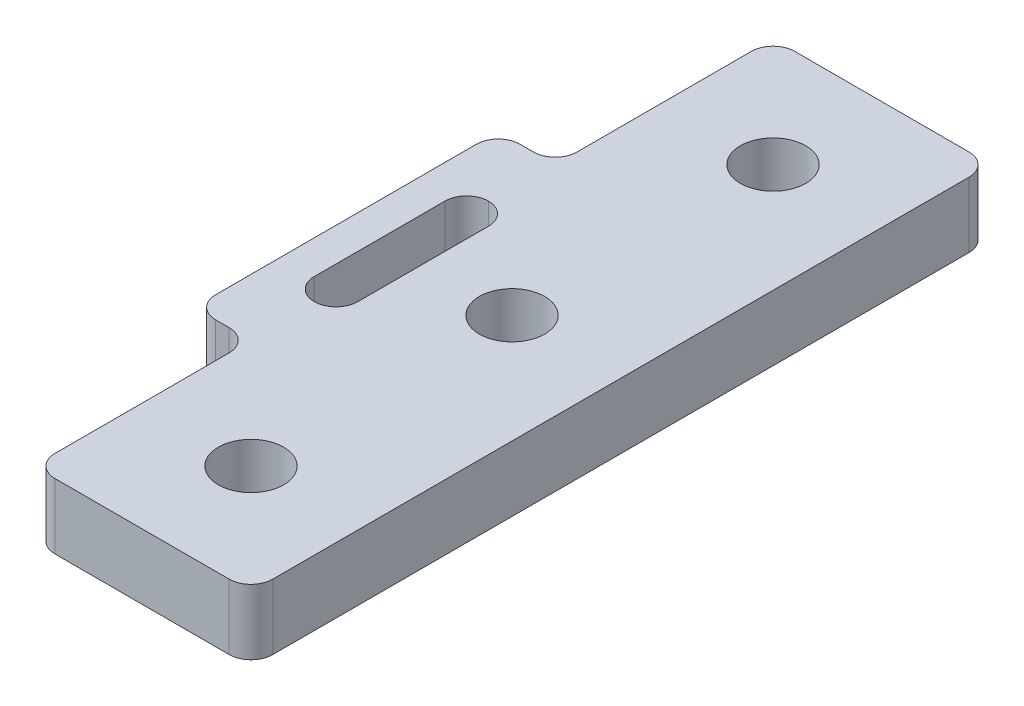
ISO-10303-21;
HEADER;
FILE_DESCRIPTION(('STEP AP214'),'2;1');
FILE_NAME('part.step','',(''),(''),'','','');
FILE_SCHEMA(('AUTOMOTIVE_DESIGN { 1 0 10303 214 1 1 1 1 }'));
ENDSEC;
DATA;
#1=APPLICATION_CONTEXT('core data for automotive mechanical design processes');
#2=APPLICATION_PROTOCOL_DEFINITION('international standard','automotive_design',2000,#1);
#3=PRODUCT_CONTEXT('',#1,'mechanical');
#4=PRODUCT('Part','Part','',(#3));
#5=PRODUCT_RELATED_PRODUCT_CATEGORY('part','',(#4));
#6=PRODUCT_DEFINITION_FORMATION('','',#4);
#7=PRODUCT_DEFINITION_CONTEXT('part definition',#1,'design');
#8=PRODUCT_DEFINITION('design','',#6,#7);
#9=PRODUCT_DEFINITION_SHAPE('','',#8);
#10=(LENGTH_UNIT() NAMED_UNIT(*) SI_UNIT(.MILLI.,.METRE.));
#11=(NAMED_UNIT(*) PLANE_ANGLE_UNIT() SI_UNIT($,.RADIAN.));
#12=(NAMED_UNIT(*) SI_UNIT($,.STERADIAN.) SOLID_ANGLE_UNIT());
#13=UNCERTAINTY_MEASURE_WITH_UNIT(LENGTH_MEASURE(1.E-05),#10,'distance_accuracy_value','');
#14=(GEOMETRIC_REPRESENTATION_CONTEXT(3) GLOBAL_UNCERTAINTY_ASSIGNED_CONTEXT((#13)) GLOBAL_UNIT_ASSIGNED_CONTEXT((#10,
#11,#12)) REPRESENTATION_CONTEXT('',''));
#15=CARTESIAN_POINT('',(0.,0.,0.));
#16=DIRECTION('',(0.,0.,1.));
#17=DIRECTION('',(1.,0.,0.));
#18=AXIS2_PLACEMENT_3D('',#15,#16,#17);
#19=CARTESIAN_POINT('',(3.54,3.,0.));
#20=DIRECTION('',(1.,0.,0.));
#21=DIRECTION('',(0.,0.,-1.));
#22=AXIS2_PLACEMENT_3D('',#19,#20,#21);
#23=PLANE('',#22);
#24=DIRECTION('',(0.,0.,1.));
#25=VECTOR('',#24,1.);
#26=CARTESIAN_POINT('',(3.54,0.,0.));
#27=LINE('',#26,#25);
#28=CARTESIAN_POINT('',(3.54,0.,-9.985));
#29=VERTEX_POINT('',#28);
#30=CARTESIAN_POINT('',(3.54,0.,-3.985));
#31=VERTEX_POINT('',#30);
#32=EDGE_CURVE('E211',#29,#31,#27,.T.);
#33=ORIENTED_EDGE('',*,*,#32,.T.);
#34=DIRECTION('',(0.,-1.,0.));
#35=VECTOR('',#34,1.);
#36=CARTESIAN_POINT('',(3.54,3.,-3.985));
#37=LINE('',#36,#35);
#38=CARTESIAN_POINT('',(3.54,3.,-3.985));
#39=VERTEX_POINT('',#38);
#40=EDGE_CURVE('E226',#31,#39,#37,.F.);
#41=ORIENTED_EDGE('',*,*,#40,.T.);
#42=DIRECTION('',(0.,0.,1.));
#43=VECTOR('',#42,1.);
#44=CARTESIAN_POINT('',(3.54,3.,0.));
#45=LINE('',#44,#43);
#46=CARTESIAN_POINT('',(3.54,3.,-9.985));
#47=VERTEX_POINT('',#46);
#48=EDGE_CURVE('E361',#47,#39,#45,.T.);
#49=ORIENTED_EDGE('',*,*,#48,.F.);
#50=DIRECTION('',(0.,-1.,0.));
#51=VECTOR('',#50,1.);
#52=CARTESIAN_POINT('',(3.54,0.,-9.985));
#53=LINE('',#52,#51);
#54=EDGE_CURVE('E217',#47,#29,#53,.T.);
#55=ORIENTED_EDGE('',*,*,#54,.T.);
#56=EDGE_LOOP('',(#33,#41,#49,#55));
#57=FACE_BOUND('',#56,.T.);
#58=ADVANCED_FACE('F38',(#57),#23,.F.);
#59=CARTESIAN_POINT('',(12.62,3.,0.));
#60=DIRECTION('',(1.,0.,0.));
#61=DIRECTION('',(0.,0.,-1.));
#62=AXIS2_PLACEMENT_3D('',#59,#60,#61);
#63=PLANE('',#62);
#64=DIRECTION('',(0.,0.,1.));
#65=VECTOR('',#64,1.);
#66=CARTESIAN_POINT('',(12.62,3.,0.));
#67=LINE('',#66,#65);
#68=CARTESIAN_POINT('',(12.62,3.,-22.97));
#69=VERTEX_POINT('',#68);
#70=CARTESIAN_POINT('',(12.62,3.,9.));
#71=VERTEX_POINT('',#70);
#72=EDGE_CURVE('E481',#69,#71,#67,.T.);
#73=ORIENTED_EDGE('',*,*,#72,.T.);
#74=DIRECTION('',(0.,-1.,0.));
#75=VECTOR('',#74,1.);
#76=CARTESIAN_POINT('',(12.62,3.,9.));
#77=LINE('',#76,#75);
#78=CARTESIAN_POINT('',(12.62,0.,9.));
#79=VERTEX_POINT('',#78);
#80=EDGE_CURVE('E247',#71,#79,#77,.T.);
#81=ORIENTED_EDGE('',*,*,#80,.T.);
#82=DIRECTION('',(0.,0.,1.));
#83=VECTOR('',#82,1.);
#84=CARTESIAN_POINT('',(12.62,0.,0.));
#85=LINE('',#84,#83);
#86=CARTESIAN_POINT('',(12.62,0.,-22.97));
#87=VERTEX_POINT('',#86);
#88=EDGE_CURVE('E367',#87,#79,#85,.T.);
#89=ORIENTED_EDGE('',*,*,#88,.F.);
#90=DIRECTION('',(0.,-1.,0.));
#91=VECTOR('',#90,1.);
#92=CARTESIAN_POINT('',(12.62,3.,-22.97));
#93=LINE('',#92,#91);
#94=EDGE_CURVE('E239',#87,#69,#93,.F.);
#95=ORIENTED_EDGE('',*,*,#94,.T.);
#96=EDGE_LOOP('',(#73,#81,#89,#95));
#97=FACE_BOUND('',#96,.T.);
#98=ADVANCED_FACE('F416',(#97),#63,.T.);
#99=CARTESIAN_POINT('',(0.,3.,-23.97));
#100=DIRECTION('',(0.,0.,1.));
#101=DIRECTION('',(1.,0.,0.));
#102=AXIS2_PLACEMENT_3D('',#99,#100,#101);
#103=PLANE('',#102);
#104=DIRECTION('',(-1.,0.,0.));
#105=VECTOR('',#104,1.);
#106=CARTESIAN_POINT('',(0.,3.,-23.97));
#107=LINE('',#106,#105);
#108=CARTESIAN_POINT('',(11.62,3.,-23.97));
#109=VERTEX_POINT('',#108);
#110=CARTESIAN_POINT('',(3.62,3.,-23.97));
#111=VERTEX_POINT('',#110);
#112=EDGE_CURVE('E347',#109,#111,#107,.T.);
#113=ORIENTED_EDGE('',*,*,#112,.F.);
#114=DIRECTION('',(0.,-1.,0.));
#115=VECTOR('',#114,1.);
#116=CARTESIAN_POINT('',(11.62,0.,-23.97));
#117=LINE('',#116,#115);
#118=CARTESIAN_POINT('',(11.62,0.,-23.97));
#119=VERTEX_POINT('',#118);
#120=EDGE_CURVE('E305',#109,#119,#117,.T.);
#121=ORIENTED_EDGE('',*,*,#120,.T.);
#122=DIRECTION('',(-1.,0.,0.));
#123=VECTOR('',#122,1.);
#124=CARTESIAN_POINT('',(0.,0.,-23.97));
#125=LINE('',#124,#123);
#126=CARTESIAN_POINT('',(3.62,0.,-23.97));
#127=VERTEX_POINT('',#126);
#128=EDGE_CURVE('E327',#119,#127,#125,.T.);
#129=ORIENTED_EDGE('',*,*,#128,.T.);
#130=DIRECTION('',(0.,-1.,0.));
#131=VECTOR('',#130,1.);
#132=CARTESIAN_POINT('',(3.62,3.,-23.97));
#133=LINE('',#132,#131);
#134=EDGE_CURVE('E303',#127,#111,#133,.F.);
#135=ORIENTED_EDGE('',*,*,#134,.T.);
#136=EDGE_LOOP('',(#113,#121,#129,#135));
#137=FACE_BOUND('',#136,.T.);
#138=ADVANCED_FACE('F421',(#137),#103,.F.);
#139=CARTESIAN_POINT('',(2.62,3.,0.));
#140=DIRECTION('',(-1.,0.,0.));
#141=DIRECTION('',(0.,0.,1.));
#142=AXIS2_PLACEMENT_3D('',#139,#140,#141);
#143=PLANE('',#142);
#144=DIRECTION('',(0.,0.,-1.));
#145=VECTOR('',#144,1.);
#146=CARTESIAN_POINT('',(2.62,0.,0.));
#147=LINE('',#146,#145);
#148=CARTESIAN_POINT('',(2.62,0.,-14.97));
#149=VERTEX_POINT('',#148);
#150=CARTESIAN_POINT('',(2.62,0.,-22.97));
#151=VERTEX_POINT('',#150);
#152=EDGE_CURVE('E316',#149,#151,#147,.T.);
#153=ORIENTED_EDGE('',*,*,#152,.F.);
#154=DIRECTION('',(0.,-1.,0.));
#155=VECTOR('',#154,1.);
#156=CARTESIAN_POINT('',(2.62,3.,-14.97));
#157=LINE('',#156,#155);
#158=CARTESIAN_POINT('',(2.62,3.,-14.97));
#159=VERTEX_POINT('',#158);
#160=EDGE_CURVE('E301',#149,#159,#157,.F.);
#161=ORIENTED_EDGE('',*,*,#160,.T.);
#162=DIRECTION('',(0.,0.,-1.));
#163=VECTOR('',#162,1.);
#164=CARTESIAN_POINT('',(2.62,3.,0.));
#165=LINE('',#164,#163);
#166=CARTESIAN_POINT('',(2.62,3.,-22.97));
#167=VERTEX_POINT('',#166);
#168=EDGE_CURVE('E338',#159,#167,#165,.T.);
#169=ORIENTED_EDGE('',*,*,#168,.T.);
#170=DIRECTION('',(0.,-1.,0.));
#171=VECTOR('',#170,1.);
#172=CARTESIAN_POINT('',(2.62,0.,-22.97));
#173=LINE('',#172,#171);
#174=EDGE_CURVE('E298',#167,#151,#173,.T.);
#175=ORIENTED_EDGE('',*,*,#174,.T.);
#176=EDGE_LOOP('',(#153,#161,#169,#175));
#177=FACE_BOUND('',#176,.T.);
#178=ADVANCED_FACE('F323',(#177),#143,.T.);
#179=CARTESIAN_POINT('',(0.,3.,-13.97));
#180=DIRECTION('',(0.,0.,1.));
#181=DIRECTION('',(1.,0.,0.));
#182=AXIS2_PLACEMENT_3D('',#179,#180,#181);
#183=PLANE('',#182);
#184=DIRECTION('',(-1.,0.,0.));
#185=VECTOR('',#184,1.);
#186=CARTESIAN_POINT('',(0.,0.,-13.97));
#187=LINE('',#186,#185);
#188=CARTESIAN_POINT('',(1.62,0.,-13.97));
#189=VERTEX_POINT('',#188);
#190=CARTESIAN_POINT('',(1.,0.,-13.97));
#191=VERTEX_POINT('',#190);
#192=EDGE_CURVE('E318',#189,#191,#187,.T.);
#193=ORIENTED_EDGE('',*,*,#192,.T.);
#194=DIRECTION('',(0.,-1.,0.));
#195=VECTOR('',#194,1.);
#196=CARTESIAN_POINT('',(1.,3.,-13.97));
#197=LINE('',#196,#195);
#198=CARTESIAN_POINT('',(1.,3.,-13.97));
#199=VERTEX_POINT('',#198);
#200=EDGE_CURVE('E296',#191,#199,#197,.F.);
#201=ORIENTED_EDGE('',*,*,#200,.T.);
#202=DIRECTION('',(-1.,0.,0.));
#203=VECTOR('',#202,1.);
#204=CARTESIAN_POINT('',(0.,3.,-13.97));
#205=LINE('',#204,#203);
#206=CARTESIAN_POINT('',(1.62,3.,-13.97));
#207=VERTEX_POINT('',#206);
#208=EDGE_CURVE('E336',#207,#199,#205,.T.);
#209=ORIENTED_EDGE('',*,*,#208,.F.);
#210=DIRECTION('',(0.,-1.,0.));
#211=VECTOR('',#210,1.);
#212=CARTESIAN_POINT('',(1.62,3.,-13.97));
#213=LINE('',#212,#211);
#214=EDGE_CURVE('E293',#207,#189,#213,.T.);
#215=ORIENTED_EDGE('',*,*,#214,.T.);
#216=EDGE_LOOP('',(#193,#201,#209,#215));
#217=FACE_BOUND('',#216,.T.);
#218=ADVANCED_FACE('F340',(#217),#183,.F.);
#219=CARTESIAN_POINT('',(0.,3.,0.));
#220=DIRECTION('',(-1.,0.,0.));
#221=DIRECTION('',(0.,0.,1.));
#222=AXIS2_PLACEMENT_3D('',#219,#220,#221);
#223=PLANE('',#222);
#224=DIRECTION('',(0.,0.,-1.));
#225=VECTOR('',#224,1.);
#226=CARTESIAN_POINT('',(0.,0.,0.));
#227=LINE('',#226,#225);
#228=CARTESIAN_POINT('',(0.,0.,-1.));
#229=VERTEX_POINT('',#228);
#230=CARTESIAN_POINT('',(0.,0.,-12.97));
#231=VERTEX_POINT('',#230);
#232=EDGE_CURVE('E372',#229,#231,#227,.T.);
#233=ORIENTED_EDGE('',*,*,#232,.F.);
#234=DIRECTION('',(0.,-1.,0.));
#235=VECTOR('',#234,1.);
#236=CARTESIAN_POINT('',(0.,3.,-1.));
#237=LINE('',#236,#235);
#238=CARTESIAN_POINT('',(0.,3.,-1.));
#239=VERTEX_POINT('',#238);
#240=EDGE_CURVE('E291',#229,#239,#237,.F.);
#241=ORIENTED_EDGE('',*,*,#240,.T.);
#242=DIRECTION('',(0.,0.,-1.));
#243=VECTOR('',#242,1.);
#244=CARTESIAN_POINT('',(0.,3.,0.));
#245=LINE('',#244,#243);
#246=CARTESIAN_POINT('',(0.,3.,-12.97));
#247=VERTEX_POINT('',#246);
#248=EDGE_CURVE('E342',#239,#247,#245,.T.);
#249=ORIENTED_EDGE('',*,*,#248,.T.);
#250=DIRECTION('',(0.,-1.,0.));
#251=VECTOR('',#250,1.);
#252=CARTESIAN_POINT('',(0.,0.,-12.97));
#253=LINE('',#252,#251);
#254=EDGE_CURVE('E288',#247,#231,#253,.T.);
#255=ORIENTED_EDGE('',*,*,#254,.T.);
#256=EDGE_LOOP('',(#233,#241,#249,#255));
#257=FACE_BOUND('',#256,.T.);
#258=ADVANCED_FACE('F442',(#257),#223,.T.);
#259=CARTESIAN_POINT('',(0.,3.,0.));
#260=DIRECTION('',(0.,0.,1.));
#261=DIRECTION('',(1.,0.,0.));
#262=AXIS2_PLACEMENT_3D('',#259,#260,#261);
#263=PLANE('',#262);
#264=DIRECTION('',(-1.,0.,0.));
#265=VECTOR('',#264,1.);
#266=CARTESIAN_POINT('',(0.,0.,0.));
#267=LINE('',#266,#265);
#268=CARTESIAN_POINT('',(1.62,0.,0.));
#269=VERTEX_POINT('',#268);
#270=CARTESIAN_POINT('',(1.,0.,0.));
#271=VERTEX_POINT('',#270);
#272=EDGE_CURVE('E375',#269,#271,#267,.T.);
#273=ORIENTED_EDGE('',*,*,#272,.F.);
#274=DIRECTION('',(0.,-1.,0.));
#275=VECTOR('',#274,1.);
#276=CARTESIAN_POINT('',(1.62,3.,0.));
#277=LINE('',#276,#275);
#278=CARTESIAN_POINT('',(1.62,3.,0.));
#279=VERTEX_POINT('',#278);
#280=EDGE_CURVE('E286',#269,#279,#277,.F.);
#281=ORIENTED_EDGE('',*,*,#280,.T.);
#282=DIRECTION('',(-1.,0.,0.));
#283=VECTOR('',#282,1.);
#284=CARTESIAN_POINT('',(0.,3.,0.));
#285=LINE('',#284,#283);
#286=CARTESIAN_POINT('',(1.,3.,0.));
#287=VERTEX_POINT('',#286);
#288=EDGE_CURVE('E345',#279,#287,#285,.T.);
#289=ORIENTED_EDGE('',*,*,#288,.T.);
#290=DIRECTION('',(0.,-1.,0.));
#291=VECTOR('',#290,1.);
#292=CARTESIAN_POINT('',(1.,3.,0.));
#293=LINE('',#292,#291);
#294=EDGE_CURVE('E283',#287,#271,#293,.T.);
#295=ORIENTED_EDGE('',*,*,#294,.T.);
#296=EDGE_LOOP('',(#273,#281,#289,#295));
#297=FACE_BOUND('',#296,.T.);
#298=ADVANCED_FACE('F439',(#297),#263,.T.);
#299=CARTESIAN_POINT('',(2.62,3.,0.));
#300=DIRECTION('',(1.,0.,0.));
#301=DIRECTION('',(0.,0.,-1.));
#302=AXIS2_PLACEMENT_3D('',#299,#300,#301);
#303=PLANE('',#302);
#304=DIRECTION('',(0.,0.,1.));
#305=VECTOR('',#304,1.);
#306=CARTESIAN_POINT('',(2.62,0.,0.));
#307=LINE('',#306,#305);
#308=CARTESIAN_POINT('',(2.62,0.,1.));
#309=VERTEX_POINT('',#308);
#310=CARTESIAN_POINT('',(2.62,0.,9.));
#311=VERTEX_POINT('',#310);
#312=EDGE_CURVE('E378',#309,#311,#307,.T.);
#313=ORIENTED_EDGE('',*,*,#312,.T.);
#314=DIRECTION('',(0.,-1.,0.));
#315=VECTOR('',#314,1.);
#316=CARTESIAN_POINT('',(2.62,3.,9.));
#317=LINE('',#316,#315);
#318=CARTESIAN_POINT('',(2.62,3.,9.));
#319=VERTEX_POINT('',#318);
#320=EDGE_CURVE('E53',#311,#319,#317,.F.);
#321=ORIENTED_EDGE('',*,*,#320,.T.);
#322=DIRECTION('',(0.,0.,1.));
#323=VECTOR('',#322,1.);
#324=CARTESIAN_POINT('',(2.62,3.,0.));
#325=LINE('',#324,#323);
#326=CARTESIAN_POINT('',(2.62,3.,1.));
#327=VERTEX_POINT('',#326);
#328=EDGE_CURVE('E353',#327,#319,#325,.T.);
#329=ORIENTED_EDGE('',*,*,#328,.F.);
#330=DIRECTION('',(0.,-1.,0.));
#331=VECTOR('',#330,1.);
#332=CARTESIAN_POINT('',(2.62,3.,1.));
#333=LINE('',#332,#331);
#334=EDGE_CURVE('E279',#327,#309,#333,.T.);
#335=ORIENTED_EDGE('',*,*,#334,.T.);
#336=EDGE_LOOP('',(#313,#321,#329,#335));
#337=FACE_BOUND('',#336,.T.);
#338=ADVANCED_FACE('F436',(#337),#303,.F.);
#339=CARTESIAN_POINT('',(1.54,3.,0.));
#340=DIRECTION('',(1.,0.,0.));
#341=DIRECTION('',(0.,0.,-1.));
#342=AXIS2_PLACEMENT_3D('',#339,#340,#341);
#343=PLANE('',#342);
#344=DIRECTION('',(0.,0.,1.));
#345=VECTOR('',#344,1.);
#346=CARTESIAN_POINT('',(1.54,3.,0.));
#347=LINE('',#346,#345);
#348=CARTESIAN_POINT('',(1.54,3.,-9.985));
#349=VERTEX_POINT('',#348);
#350=CARTESIAN_POINT('',(1.54,3.,-3.985));
#351=VERTEX_POINT('',#350);
#352=EDGE_CURVE('E220',#349,#351,#347,.T.);
#353=ORIENTED_EDGE('',*,*,#352,.T.);
#354=DIRECTION('',(0.,-1.,0.));
#355=VECTOR('',#354,1.);
#356=CARTESIAN_POINT('',(1.54,0.,-3.985));
#357=LINE('',#356,#355);
#358=CARTESIAN_POINT('',(1.54,0.,-3.985));
#359=VERTEX_POINT('',#358);
#360=EDGE_CURVE('E209',#351,#359,#357,.T.);
#361=ORIENTED_EDGE('',*,*,#360,.T.);
#362=DIRECTION('',(0.,0.,1.));
#363=VECTOR('',#362,1.);
#364=CARTESIAN_POINT('',(1.54,0.,0.));
#365=LINE('',#364,#363);
#366=CARTESIAN_POINT('',(1.54,0.,-9.985));
#367=VERTEX_POINT('',#366);
#368=EDGE_CURVE('E192',#367,#359,#365,.T.);
#369=ORIENTED_EDGE('',*,*,#368,.F.);
#370=DIRECTION('',(0.,-1.,0.));
#371=VECTOR('',#370,1.);
#372=CARTESIAN_POINT('',(1.54,3.,-9.985));
#373=LINE('',#372,#371);
#374=EDGE_CURVE('E206',#367,#349,#373,.F.);
#375=ORIENTED_EDGE('',*,*,#374,.T.);
#376=EDGE_LOOP('',(#353,#361,#369,#375));
#377=FACE_BOUND('',#376,.T.);
#378=ADVANCED_FACE('F205',(#377),#343,.T.);
#379=CARTESIAN_POINT('',(7.62,3.,-6.985));
#380=DIRECTION('',(0.,-1.,0.));
#381=DIRECTION('',(0.,0.,-1.));
#382=AXIS2_PLACEMENT_3D('',#379,#380,#381);
#383=CYLINDRICAL_SURFACE('',#382,1.5);
#384=CARTESIAN_POINT('',(7.62,3.,-6.985));
#385=DIRECTION('',(0.,1.,0.));
#386=DIRECTION('',(0.,0.,1.));
#387=AXIS2_PLACEMENT_3D('',#384,#385,#386);
#388=CIRCLE('',#387,1.5);
#389=CARTESIAN_POINT('',(7.62,3.,-5.485));
#390=VERTEX_POINT('',#389);
#391=EDGE_CURVE('E358',#390,#390,#388,.T.);
#392=ORIENTED_EDGE('',*,*,#391,.T.);
#393=EDGE_LOOP('',(#392));
#394=FACE_BOUND('',#393,.T.);
#395=CARTESIAN_POINT('',(7.62,0.,-6.985));
#396=DIRECTION('',(0.,1.,0.));
#397=DIRECTION('',(0.,0.,1.));
#398=AXIS2_PLACEMENT_3D('',#395,#396,#397);
#399=CIRCLE('',#398,1.5);
#400=CARTESIAN_POINT('',(7.62,0.,-5.485));
#401=VERTEX_POINT('',#400);
#402=EDGE_CURVE('E383',#401,#401,#399,.T.);
#403=ORIENTED_EDGE('',*,*,#402,.F.);
#404=EDGE_LOOP('',(#403));
#405=FACE_BOUND('',#404,.T.);
#406=ADVANCED_FACE('F427',(#394,#405),#383,.F.);
#407=CARTESIAN_POINT('',(0.,3.,10.));
#408=DIRECTION('',(0.,0.,1.));
#409=DIRECTION('',(1.,0.,0.));
#410=AXIS2_PLACEMENT_3D('',#407,#408,#409);
#411=PLANE('',#410);
#412=DIRECTION('',(-1.,0.,0.));
#413=VECTOR('',#412,1.);
#414=CARTESIAN_POINT('',(0.,0.,10.));
#415=LINE('',#414,#413);
#416=CARTESIAN_POINT('',(11.62,0.,10.));
#417=VERTEX_POINT('',#416);
#418=CARTESIAN_POINT('',(3.62,0.,10.));
#419=VERTEX_POINT('',#418);
#420=EDGE_CURVE('E380',#417,#419,#415,.T.);
#421=ORIENTED_EDGE('',*,*,#420,.F.);
#422=DIRECTION('',(0.,-1.,0.));
#423=VECTOR('',#422,1.);
#424=CARTESIAN_POINT('',(11.62,3.,10.));
#425=LINE('',#424,#423);
#426=CARTESIAN_POINT('',(11.62,3.,10.));
#427=VERTEX_POINT('',#426);
#428=EDGE_CURVE('E265',#417,#427,#425,.F.);
#429=ORIENTED_EDGE('',*,*,#428,.T.);
#430=DIRECTION('',(-1.,0.,0.));
#431=VECTOR('',#430,1.);
#432=CARTESIAN_POINT('',(0.,3.,10.));
#433=LINE('',#432,#431);
#434=CARTESIAN_POINT('',(3.62,3.,10.));
#435=VERTEX_POINT('',#434);
#436=EDGE_CURVE('E355',#427,#435,#433,.T.);
#437=ORIENTED_EDGE('',*,*,#436,.T.);
#438=DIRECTION('',(0.,-1.,0.));
#439=VECTOR('',#438,1.);
#440=CARTESIAN_POINT('',(3.62,0.,10.));
#441=LINE('',#440,#439);
#442=EDGE_CURVE('E262',#435,#419,#441,.T.);
#443=ORIENTED_EDGE('',*,*,#442,.T.);
#444=EDGE_LOOP('',(#421,#429,#437,#443));
#445=FACE_BOUND('',#444,.T.);
#446=ADVANCED_FACE('F430',(#445),#411,.T.);
#447=CARTESIAN_POINT('',(7.62,3.,5.));
#448=DIRECTION('',(0.,-1.,0.));
#449=DIRECTION('',(0.,0.,-1.));
#450=AXIS2_PLACEMENT_3D('',#447,#448,#449);
#451=CYLINDRICAL_SURFACE('',#450,1.5);
#452=CARTESIAN_POINT('',(7.62,3.,5.));
#453=DIRECTION('',(0.,1.,0.));
#454=DIRECTION('',(0.,0.,1.));
#455=AXIS2_PLACEMENT_3D('',#452,#453,#454);
#456=CIRCLE('',#455,1.5);
#457=CARTESIAN_POINT('',(7.62,3.,6.5));
#458=VERTEX_POINT('',#457);
#459=EDGE_CURVE('E479',#458,#458,#456,.T.);
#460=ORIENTED_EDGE('',*,*,#459,.T.);
#461=EDGE_LOOP('',(#460));
#462=FACE_BOUND('',#461,.T.);
#463=CARTESIAN_POINT('',(7.62,0.,5.));
#464=DIRECTION('',(0.,1.,0.));
#465=DIRECTION('',(0.,0.,1.));
#466=AXIS2_PLACEMENT_3D('',#463,#464,#465);
#467=CIRCLE('',#466,1.5);
#468=CARTESIAN_POINT('',(7.62,0.,6.5));
#469=VERTEX_POINT('',#468);
#470=EDGE_CURVE('E243',#469,#469,#467,.T.);
#471=ORIENTED_EDGE('',*,*,#470,.F.);
#472=EDGE_LOOP('',(#471));
#473=FACE_BOUND('',#472,.T.);
#474=ADVANCED_FACE('F434',(#462,#473),#451,.F.);
#475=CARTESIAN_POINT('',(7.62,3.,-18.97));
#476=DIRECTION('',(0.,-1.,0.));
#477=DIRECTION('',(0.,0.,-1.));
#478=AXIS2_PLACEMENT_3D('',#475,#476,#477);
#479=CYLINDRICAL_SURFACE('',#478,1.5);
#480=CARTESIAN_POINT('',(7.62,3.,-18.97));
#481=DIRECTION('',(0.,1.,0.));
#482=DIRECTION('',(0.,0.,1.));
#483=AXIS2_PLACEMENT_3D('',#480,#481,#482);
#484=CIRCLE('',#483,1.5);
#485=CARTESIAN_POINT('',(7.62,3.,-17.47));
#486=VERTEX_POINT('',#485);
#487=EDGE_CURVE('E215',#486,#486,#484,.T.);
#488=ORIENTED_EDGE('',*,*,#487,.T.);
#489=EDGE_LOOP('',(#488));
#490=FACE_BOUND('',#489,.T.);
#491=CARTESIAN_POINT('',(7.62,0.,-18.97));
#492=DIRECTION('',(0.,1.,0.));
#493=DIRECTION('',(0.,0.,1.));
#494=AXIS2_PLACEMENT_3D('',#491,#492,#493);
#495=CIRCLE('',#494,1.5);
#496=CARTESIAN_POINT('',(7.62,0.,-17.47));
#497=VERTEX_POINT('',#496);
#498=EDGE_CURVE('E210',#497,#497,#495,.T.);
#499=ORIENTED_EDGE('',*,*,#498,.F.);
#500=EDGE_LOOP('',(#499));
#501=FACE_BOUND('',#500,.T.);
#502=ADVANCED_FACE('F456',(#490,#501),#479,.F.);
#503=CARTESIAN_POINT('',(0.,3.,0.));
#504=DIRECTION('',(0.,1.,0.));
#505=DIRECTION('',(0.,0.,1.));
#506=AXIS2_PLACEMENT_3D('',#503,#504,#505);
#507=PLANE('',#506);
#508=ORIENTED_EDGE('',*,*,#459,.F.);
#509=EDGE_LOOP('',(#508));
#510=FACE_BOUND('',#509,.T.);
#511=ORIENTED_EDGE('',*,*,#436,.F.);
#512=CARTESIAN_POINT('',(11.62,3.,9.));
#513=DIRECTION('',(0.,1.,0.));
#514=DIRECTION('',(0.,0.,1.));
#515=AXIS2_PLACEMENT_3D('',#512,#513,#514);
#516=CIRCLE('',#515,1.);
#517=EDGE_CURVE('E277',#427,#71,#516,.T.);
#518=ORIENTED_EDGE('',*,*,#517,.T.);
#519=ORIENTED_EDGE('',*,*,#72,.F.);
#520=CARTESIAN_POINT('',(11.62,3.,-22.97));
#521=DIRECTION('',(0.,1.,0.));
#522=DIRECTION('',(0.,0.,1.));
#523=AXIS2_PLACEMENT_3D('',#520,#521,#522);
#524=CIRCLE('',#523,1.);
#525=EDGE_CURVE('E269',#69,#109,#524,.T.);
#526=ORIENTED_EDGE('',*,*,#525,.T.);
#527=ORIENTED_EDGE('',*,*,#112,.T.);
#528=CARTESIAN_POINT('',(3.62,3.,-22.97));
#529=DIRECTION('',(0.,1.,0.));
#530=DIRECTION('',(0.,0.,1.));
#531=AXIS2_PLACEMENT_3D('',#528,#529,#530);
#532=CIRCLE('',#531,1.);
#533=EDGE_CURVE('E267',#111,#167,#532,.T.);
#534=ORIENTED_EDGE('',*,*,#533,.T.);
#535=ORIENTED_EDGE('',*,*,#168,.F.);
#536=CARTESIAN_POINT('',(1.62,3.,-14.97));
#537=DIRECTION('',(0.,1.,0.));
#538=DIRECTION('',(0.,0.,1.));
#539=AXIS2_PLACEMENT_3D('',#536,#537,#538);
#540=CIRCLE('',#539,1.);
#541=EDGE_CURVE('E11',#159,#207,#540,.F.);
#542=ORIENTED_EDGE('',*,*,#541,.T.);
#543=ORIENTED_EDGE('',*,*,#208,.T.);
#544=CARTESIAN_POINT('',(1.,3.,-12.97));
#545=DIRECTION('',(0.,1.,0.));
#546=DIRECTION('',(0.,0.,1.));
#547=AXIS2_PLACEMENT_3D('',#544,#545,#546);
#548=CIRCLE('',#547,1.);
#549=EDGE_CURVE('E271',#199,#247,#548,.T.);
#550=ORIENTED_EDGE('',*,*,#549,.T.);
#551=ORIENTED_EDGE('',*,*,#248,.F.);
#552=CARTESIAN_POINT('',(1.,3.,-1.));
#553=DIRECTION('',(0.,1.,0.));
#554=DIRECTION('',(0.,0.,1.));
#555=AXIS2_PLACEMENT_3D('',#552,#553,#554);
#556=CIRCLE('',#555,1.);
#557=EDGE_CURVE('E273',#239,#287,#556,.T.);
#558=ORIENTED_EDGE('',*,*,#557,.T.);
#559=ORIENTED_EDGE('',*,*,#288,.F.);
#560=CARTESIAN_POINT('',(1.62,3.,1.));
#561=DIRECTION('',(0.,1.,0.));
#562=DIRECTION('',(0.,0.,1.));
#563=AXIS2_PLACEMENT_3D('',#560,#561,#562);
#564=CIRCLE('',#563,1.);
#565=EDGE_CURVE('E60',#279,#327,#564,.F.);
#566=ORIENTED_EDGE('',*,*,#565,.T.);
#567=ORIENTED_EDGE('',*,*,#328,.T.);
#568=CARTESIAN_POINT('',(3.62,3.,9.));
#569=DIRECTION('',(0.,1.,0.));
#570=DIRECTION('',(0.,0.,1.));
#571=AXIS2_PLACEMENT_3D('',#568,#569,#570);
#572=CIRCLE('',#571,1.);
#573=EDGE_CURVE('E275',#319,#435,#572,.T.);
#574=ORIENTED_EDGE('',*,*,#573,.T.);
#575=EDGE_LOOP('',(#511,#518,#519,#526,#527,#534,#535,#542,#543,#550,#551,#558,#559,#566,#567,#574));
#576=FACE_BOUND('',#575,.T.);
#577=ORIENTED_EDGE('',*,*,#391,.F.);
#578=EDGE_LOOP('',(#577));
#579=FACE_BOUND('',#578,.T.);
#580=ORIENTED_EDGE('',*,*,#352,.F.);
#581=CARTESIAN_POINT('',(2.54,3.,-9.985));
#582=DIRECTION('',(0.,1.,0.));
#583=DIRECTION('',(0.,0.,1.));
#584=AXIS2_PLACEMENT_3D('',#581,#582,#583);
#585=CIRCLE('',#584,1.);
#586=CARTESIAN_POINT('',(2.54,3.,-10.985));
#587=VERTEX_POINT('',#586);
#588=EDGE_CURVE('E199',#349,#587,#585,.F.);
#589=ORIENTED_EDGE('',*,*,#588,.T.);
#590=CARTESIAN_POINT('',(2.54,3.,-9.985));
#591=DIRECTION('',(0.,1.,0.));
#592=DIRECTION('',(0.,0.,1.));
#593=AXIS2_PLACEMENT_3D('',#590,#591,#592);
#594=CIRCLE('',#593,1.);
#595=EDGE_CURVE('E200',#587,#47,#594,.F.);
#596=ORIENTED_EDGE('',*,*,#595,.T.);
#597=ORIENTED_EDGE('',*,*,#48,.T.);
#598=CARTESIAN_POINT('',(2.54,3.,-3.985));
#599=DIRECTION('',(0.,1.,0.));
#600=DIRECTION('',(0.,0.,1.));
#601=AXIS2_PLACEMENT_3D('',#598,#599,#600);
#602=CIRCLE('',#601,1.);
#603=CARTESIAN_POINT('',(2.54,3.,-2.985));
#604=VERTEX_POINT('',#603);
#605=EDGE_CURVE('E234',#39,#604,#602,.F.);
#606=ORIENTED_EDGE('',*,*,#605,.T.);
#607=CARTESIAN_POINT('',(2.54,3.,-3.985));
#608=DIRECTION('',(0.,1.,0.));
#609=DIRECTION('',(0.,0.,1.));
#610=AXIS2_PLACEMENT_3D('',#607,#608,#609);
#611=CIRCLE('',#610,1.);
#612=EDGE_CURVE('E230',#604,#351,#611,.F.);
#613=ORIENTED_EDGE('',*,*,#612,.T.);
#614=EDGE_LOOP('',(#580,#589,#596,#597,#606,#613));
#615=FACE_BOUND('',#614,.T.);
#616=ORIENTED_EDGE('',*,*,#487,.F.);
#617=EDGE_LOOP('',(#616));
#618=FACE_BOUND('',#617,.T.);
#619=ADVANCED_FACE('F334',(#510,#576,#579,#615,#618),#507,.T.);
#620=CARTESIAN_POINT('',(0.,0.,0.));
#621=DIRECTION('',(0.,1.,0.));
#622=DIRECTION('',(0.,0.,1.));
#623=AXIS2_PLACEMENT_3D('',#620,#621,#622);
#624=PLANE('',#623);
#625=ORIENTED_EDGE('',*,*,#470,.T.);
#626=EDGE_LOOP('',(#625));
#627=FACE_BOUND('',#626,.T.);
#628=ORIENTED_EDGE('',*,*,#88,.T.);
#629=CARTESIAN_POINT('',(11.62,0.,9.));
#630=DIRECTION('',(0.,1.,0.));
#631=DIRECTION('',(0.,0.,1.));
#632=AXIS2_PLACEMENT_3D('',#629,#630,#631);
#633=CIRCLE('',#632,1.);
#634=EDGE_CURVE('E260',#79,#417,#633,.F.);
#635=ORIENTED_EDGE('',*,*,#634,.T.);
#636=ORIENTED_EDGE('',*,*,#420,.T.);
#637=CARTESIAN_POINT('',(3.62,0.,9.));
#638=DIRECTION('',(0.,1.,0.));
#639=DIRECTION('',(0.,0.,1.));
#640=AXIS2_PLACEMENT_3D('',#637,#638,#639);
#641=CIRCLE('',#640,1.);
#642=EDGE_CURVE('E258',#419,#311,#641,.F.);
#643=ORIENTED_EDGE('',*,*,#642,.T.);
#644=ORIENTED_EDGE('',*,*,#312,.F.);
#645=CARTESIAN_POINT('',(1.62,0.,1.));
#646=DIRECTION('',(0.,1.,0.));
#647=DIRECTION('',(0.,0.,1.));
#648=AXIS2_PLACEMENT_3D('',#645,#646,#647);
#649=CIRCLE('',#648,1.);
#650=EDGE_CURVE('E308',#309,#269,#649,.T.);
#651=ORIENTED_EDGE('',*,*,#650,.T.);
#652=ORIENTED_EDGE('',*,*,#272,.T.);
#653=CARTESIAN_POINT('',(1.,0.,-1.));
#654=DIRECTION('',(0.,1.,0.));
#655=DIRECTION('',(0.,0.,1.));
#656=AXIS2_PLACEMENT_3D('',#653,#654,#655);
#657=CIRCLE('',#656,1.);
#658=EDGE_CURVE('E256',#271,#229,#657,.F.);
#659=ORIENTED_EDGE('',*,*,#658,.T.);
#660=ORIENTED_EDGE('',*,*,#232,.T.);
#661=CARTESIAN_POINT('',(1.,0.,-12.97));
#662=DIRECTION('',(0.,1.,0.));
#663=DIRECTION('',(0.,0.,1.));
#664=AXIS2_PLACEMENT_3D('',#661,#662,#663);
#665=CIRCLE('',#664,1.);
#666=EDGE_CURVE('E254',#231,#191,#665,.F.);
#667=ORIENTED_EDGE('',*,*,#666,.T.);
#668=ORIENTED_EDGE('',*,*,#192,.F.);
#669=CARTESIAN_POINT('',(1.62,0.,-14.97));
#670=DIRECTION('',(0.,1.,0.));
#671=DIRECTION('',(0.,0.,1.));
#672=AXIS2_PLACEMENT_3D('',#669,#670,#671);
#673=CIRCLE('',#672,1.);
#674=EDGE_CURVE('E46',#189,#149,#673,.T.);
#675=ORIENTED_EDGE('',*,*,#674,.T.);
#676=ORIENTED_EDGE('',*,*,#152,.T.);
#677=CARTESIAN_POINT('',(3.62,0.,-22.97));
#678=DIRECTION('',(0.,1.,0.));
#679=DIRECTION('',(0.,0.,1.));
#680=AXIS2_PLACEMENT_3D('',#677,#678,#679);
#681=CIRCLE('',#680,1.);
#682=EDGE_CURVE('E250',#151,#127,#681,.F.);
#683=ORIENTED_EDGE('',*,*,#682,.T.);
#684=ORIENTED_EDGE('',*,*,#128,.F.);
#685=CARTESIAN_POINT('',(11.62,0.,-22.97));
#686=DIRECTION('',(0.,1.,0.));
#687=DIRECTION('',(0.,0.,1.));
#688=AXIS2_PLACEMENT_3D('',#685,#686,#687);
#689=CIRCLE('',#688,1.);
#690=EDGE_CURVE('E252',#119,#87,#689,.F.);
#691=ORIENTED_EDGE('',*,*,#690,.T.);
#692=EDGE_LOOP('',(#628,#635,#636,#643,#644,#651,#652,#659,#660,#667,#668,#675,#676,#683,#684,#691));
#693=FACE_BOUND('',#692,.T.);
#694=ORIENTED_EDGE('',*,*,#402,.T.);
#695=EDGE_LOOP('',(#694));
#696=FACE_BOUND('',#695,.T.);
#697=CARTESIAN_POINT('',(2.54,0.,-9.985));
#698=DIRECTION('',(0.,1.,0.));
#699=DIRECTION('',(0.,0.,1.));
#700=AXIS2_PLACEMENT_3D('',#697,#698,#699);
#701=CIRCLE('',#700,1.);
#702=CARTESIAN_POINT('',(2.54,0.,-10.985));
#703=VERTEX_POINT('',#702);
#704=EDGE_CURVE('E194',#29,#703,#701,.T.);
#705=ORIENTED_EDGE('',*,*,#704,.T.);
#706=CARTESIAN_POINT('',(2.54,0.,-9.985));
#707=DIRECTION('',(0.,1.,0.));
#708=DIRECTION('',(0.,0.,1.));
#709=AXIS2_PLACEMENT_3D('',#706,#707,#708);
#710=CIRCLE('',#709,1.);
#711=EDGE_CURVE('E188',#703,#367,#710,.T.);
#712=ORIENTED_EDGE('',*,*,#711,.T.);
#713=ORIENTED_EDGE('',*,*,#368,.T.);
#714=CARTESIAN_POINT('',(2.54,0.,-3.985));
#715=DIRECTION('',(0.,1.,0.));
#716=DIRECTION('',(0.,0.,1.));
#717=AXIS2_PLACEMENT_3D('',#714,#715,#716);
#718=CIRCLE('',#717,1.);
#719=CARTESIAN_POINT('',(2.54,0.,-2.985));
#720=VERTEX_POINT('',#719);
#721=EDGE_CURVE('E228',#359,#720,#718,.T.);
#722=ORIENTED_EDGE('',*,*,#721,.T.);
#723=CARTESIAN_POINT('',(2.54,0.,-3.985));
#724=DIRECTION('',(0.,1.,0.));
#725=DIRECTION('',(0.,0.,1.));
#726=AXIS2_PLACEMENT_3D('',#723,#724,#725);
#727=CIRCLE('',#726,1.);
#728=EDGE_CURVE('E232',#720,#31,#727,.T.);
#729=ORIENTED_EDGE('',*,*,#728,.T.);
#730=ORIENTED_EDGE('',*,*,#32,.F.);
#731=EDGE_LOOP('',(#705,#712,#713,#722,#729,#730));
#732=FACE_BOUND('',#731,.T.);
#733=ORIENTED_EDGE('',*,*,#498,.T.);
#734=EDGE_LOOP('',(#733));
#735=FACE_BOUND('',#734,.T.);
#736=ADVANCED_FACE('F190',(#627,#693,#696,#732,#735),#624,.F.);
#737=CARTESIAN_POINT('',(2.54,3.,-3.985));
#738=DIRECTION('',(0.,-1.,0.));
#739=DIRECTION('',(0.,0.,-1.));
#740=AXIS2_PLACEMENT_3D('',#737,#738,#739);
#741=CYLINDRICAL_SURFACE('',#740,1.);
#742=DIRECTION('',(0.,-1.,0.));
#743=VECTOR('',#742,1.);
#744=CARTESIAN_POINT('',(2.54,3.,-2.985));
#745=LINE('',#744,#743);
#746=EDGE_CURVE('E240',#604,#720,#745,.T.);
#747=ORIENTED_EDGE('',*,*,#746,.F.);
#748=ORIENTED_EDGE('',*,*,#605,.F.);
#749=ORIENTED_EDGE('',*,*,#40,.F.);
#750=ORIENTED_EDGE('',*,*,#728,.F.);
#751=EDGE_LOOP('',(#747,#748,#749,#750));
#752=FACE_BOUND('',#751,.T.);
#753=ADVANCED_FACE('F395',(#752),#741,.F.);
#754=CARTESIAN_POINT('',(2.54,3.,-3.985));
#755=DIRECTION('',(0.,1.,0.));
#756=DIRECTION('',(0.,0.,1.));
#757=AXIS2_PLACEMENT_3D('',#754,#755,#756);
#758=CYLINDRICAL_SURFACE('',#757,1.);
#759=ORIENTED_EDGE('',*,*,#612,.F.);
#760=ORIENTED_EDGE('',*,*,#746,.T.);
#761=ORIENTED_EDGE('',*,*,#721,.F.);
#762=ORIENTED_EDGE('',*,*,#360,.F.);
#763=EDGE_LOOP('',(#759,#760,#761,#762));
#764=FACE_BOUND('',#763,.T.);
#765=ADVANCED_FACE('F412',(#764),#758,.F.);
#766=CARTESIAN_POINT('',(2.54,3.,-9.985));
#767=DIRECTION('',(0.,-1.,0.));
#768=DIRECTION('',(0.,0.,-1.));
#769=AXIS2_PLACEMENT_3D('',#766,#767,#768);
#770=CYLINDRICAL_SURFACE('',#769,1.);
#771=DIRECTION('',(0.,-1.,0.));
#772=VECTOR('',#771,1.);
#773=CARTESIAN_POINT('',(2.54,3.,-10.985));
#774=LINE('',#773,#772);
#775=EDGE_CURVE('E244',#587,#703,#774,.T.);
#776=ORIENTED_EDGE('',*,*,#775,.F.);
#777=ORIENTED_EDGE('',*,*,#588,.F.);
#778=ORIENTED_EDGE('',*,*,#374,.F.);
#779=ORIENTED_EDGE('',*,*,#711,.F.);
#780=EDGE_LOOP('',(#776,#777,#778,#779));
#781=FACE_BOUND('',#780,.T.);
#782=ADVANCED_FACE('F214',(#781),#770,.F.);
#783=CARTESIAN_POINT('',(2.54,3.,-9.985));
#784=DIRECTION('',(0.,1.,0.));
#785=DIRECTION('',(0.,0.,1.));
#786=AXIS2_PLACEMENT_3D('',#783,#784,#785);
#787=CYLINDRICAL_SURFACE('',#786,1.);
#788=ORIENTED_EDGE('',*,*,#595,.F.);
#789=ORIENTED_EDGE('',*,*,#775,.T.);
#790=ORIENTED_EDGE('',*,*,#704,.F.);
#791=ORIENTED_EDGE('',*,*,#54,.F.);
#792=EDGE_LOOP('',(#788,#789,#790,#791));
#793=FACE_BOUND('',#792,.T.);
#794=ADVANCED_FACE('F401',(#793),#787,.F.);
#795=CARTESIAN_POINT('',(11.62,3.,9.));
#796=DIRECTION('',(0.,-1.,0.));
#797=DIRECTION('',(0.,0.,-1.));
#798=AXIS2_PLACEMENT_3D('',#795,#796,#797);
#799=CYLINDRICAL_SURFACE('',#798,1.);
#800=ORIENTED_EDGE('',*,*,#517,.F.);
#801=ORIENTED_EDGE('',*,*,#428,.F.);
#802=ORIENTED_EDGE('',*,*,#634,.F.);
#803=ORIENTED_EDGE('',*,*,#80,.F.);
#804=EDGE_LOOP('',(#800,#801,#802,#803));
#805=FACE_BOUND('',#804,.T.);
#806=ADVANCED_FACE('F403',(#805),#799,.T.);
#807=CARTESIAN_POINT('',(3.62,3.,9.));
#808=DIRECTION('',(0.,1.,0.));
#809=DIRECTION('',(0.,0.,1.));
#810=AXIS2_PLACEMENT_3D('',#807,#808,#809);
#811=CYLINDRICAL_SURFACE('',#810,1.);
#812=ORIENTED_EDGE('',*,*,#573,.F.);
#813=ORIENTED_EDGE('',*,*,#320,.F.);
#814=ORIENTED_EDGE('',*,*,#642,.F.);
#815=ORIENTED_EDGE('',*,*,#442,.F.);
#816=EDGE_LOOP('',(#812,#813,#814,#815));
#817=FACE_BOUND('',#816,.T.);
#818=ADVANCED_FACE('F409',(#817),#811,.T.);
#819=CARTESIAN_POINT('',(1.62,3.,1.));
#820=DIRECTION('',(0.,-1.,0.));
#821=DIRECTION('',(0.,0.,-1.));
#822=AXIS2_PLACEMENT_3D('',#819,#820,#821);
#823=CYLINDRICAL_SURFACE('',#822,1.);
#824=ORIENTED_EDGE('',*,*,#565,.F.);
#825=ORIENTED_EDGE('',*,*,#280,.F.);
#826=ORIENTED_EDGE('',*,*,#650,.F.);
#827=ORIENTED_EDGE('',*,*,#334,.F.);
#828=EDGE_LOOP('',(#824,#825,#826,#827));
#829=FACE_BOUND('',#828,.T.);
#830=ADVANCED_FACE('F509',(#829),#823,.F.);
#831=CARTESIAN_POINT('',(1.,3.,-1.));
#832=DIRECTION('',(0.,-1.,0.));
#833=DIRECTION('',(0.,0.,-1.));
#834=AXIS2_PLACEMENT_3D('',#831,#832,#833);
#835=CYLINDRICAL_SURFACE('',#834,1.);
#836=ORIENTED_EDGE('',*,*,#557,.F.);
#837=ORIENTED_EDGE('',*,*,#240,.F.);
#838=ORIENTED_EDGE('',*,*,#658,.F.);
#839=ORIENTED_EDGE('',*,*,#294,.F.);
#840=EDGE_LOOP('',(#836,#837,#838,#839));
#841=FACE_BOUND('',#840,.T.);
#842=ADVANCED_FACE('F515',(#841),#835,.T.);
#843=CARTESIAN_POINT('',(1.,3.,-12.97));
#844=DIRECTION('',(0.,1.,0.));
#845=DIRECTION('',(0.,0.,1.));
#846=AXIS2_PLACEMENT_3D('',#843,#844,#845);
#847=CYLINDRICAL_SURFACE('',#846,1.);
#848=ORIENTED_EDGE('',*,*,#549,.F.);
#849=ORIENTED_EDGE('',*,*,#200,.F.);
#850=ORIENTED_EDGE('',*,*,#666,.F.);
#851=ORIENTED_EDGE('',*,*,#254,.F.);
#852=EDGE_LOOP('',(#848,#849,#850,#851));
#853=FACE_BOUND('',#852,.T.);
#854=ADVANCED_FACE('F521',(#853),#847,.T.);
#855=CARTESIAN_POINT('',(1.62,3.,-14.97));
#856=DIRECTION('',(0.,-1.,0.));
#857=DIRECTION('',(0.,0.,-1.));
#858=AXIS2_PLACEMENT_3D('',#855,#856,#857);
#859=CYLINDRICAL_SURFACE('',#858,1.);
#860=ORIENTED_EDGE('',*,*,#541,.F.);
#861=ORIENTED_EDGE('',*,*,#160,.F.);
#862=ORIENTED_EDGE('',*,*,#674,.F.);
#863=ORIENTED_EDGE('',*,*,#214,.F.);
#864=EDGE_LOOP('',(#860,#861,#862,#863));
#865=FACE_BOUND('',#864,.T.);
#866=ADVANCED_FACE('F330',(#865),#859,.F.);
#867=CARTESIAN_POINT('',(11.62,3.,-22.97));
#868=DIRECTION('',(0.,1.,0.));
#869=DIRECTION('',(0.,0.,1.));
#870=AXIS2_PLACEMENT_3D('',#867,#868,#869);
#871=CYLINDRICAL_SURFACE('',#870,1.);
#872=ORIENTED_EDGE('',*,*,#525,.F.);
#873=ORIENTED_EDGE('',*,*,#94,.F.);
#874=ORIENTED_EDGE('',*,*,#690,.F.);
#875=ORIENTED_EDGE('',*,*,#120,.F.);
#876=EDGE_LOOP('',(#872,#873,#874,#875));
#877=FACE_BOUND('',#876,.T.);
#878=ADVANCED_FACE('F496',(#877),#871,.T.);
#879=CARTESIAN_POINT('',(3.62,3.,-22.97));
#880=DIRECTION('',(0.,1.,0.));
#881=DIRECTION('',(0.,0.,1.));
#882=AXIS2_PLACEMENT_3D('',#879,#880,#881);
#883=CYLINDRICAL_SURFACE('',#882,1.);
#884=ORIENTED_EDGE('',*,*,#533,.F.);
#885=ORIENTED_EDGE('',*,*,#134,.F.);
#886=ORIENTED_EDGE('',*,*,#682,.F.);
#887=ORIENTED_EDGE('',*,*,#174,.F.);
#888=EDGE_LOOP('',(#884,#885,#886,#887));
#889=FACE_BOUND('',#888,.T.);
#890=ADVANCED_FACE('F40',(#889),#883,.T.);
#891=CLOSED_SHELL('',(#58,#98,#138,#178,#218,#258,#298,#338,#378,#406,#446,#474,#502,#619,#736,
#753,#765,#782,#794,#806,#818,#830,#842,#854,#866,#878,#890));
#892=MANIFOLD_SOLID_BREP('B2',#891);
#893=ADVANCED_BREP_SHAPE_REPRESENTATION('',(#18,#892),#14);
#894=SHAPE_DEFINITION_REPRESENTATION(#9,#893);
ENDSEC;
END-ISO-10303-21;
